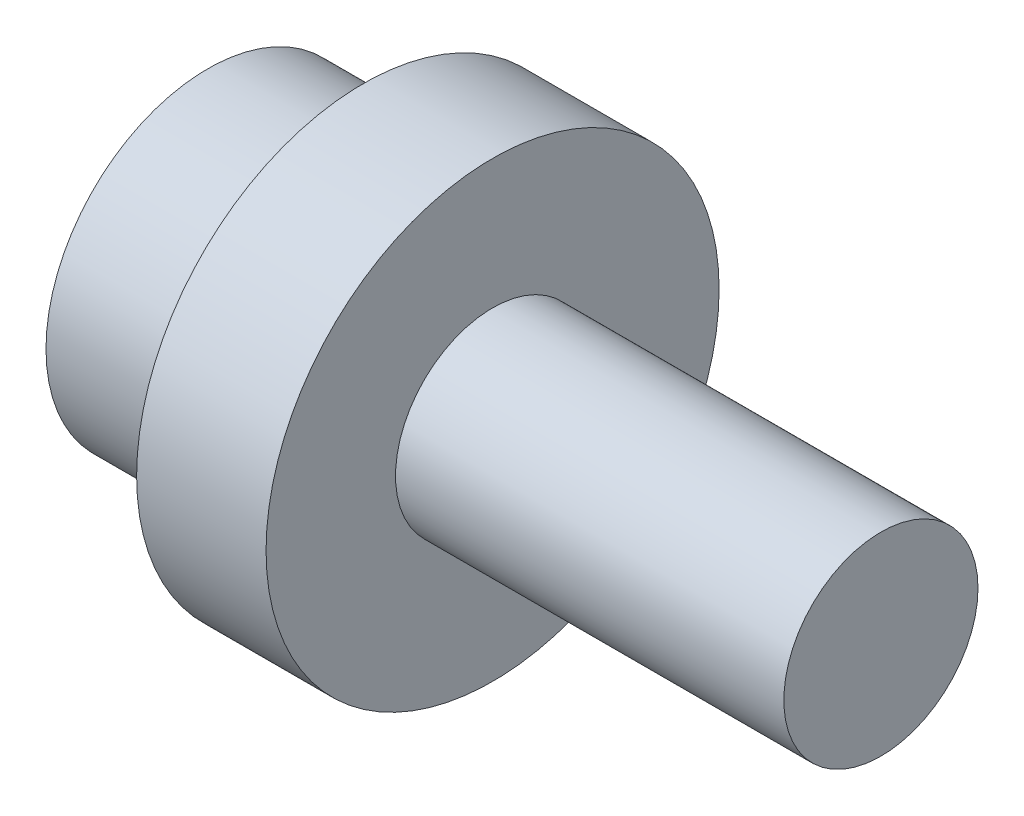
ISO-10303-21;
HEADER;
FILE_DESCRIPTION(('STEP AP214'),'2;1');
FILE_NAME('part.step','',(''),(''),'','','');
FILE_SCHEMA(('AUTOMOTIVE_DESIGN { 1 0 10303 214 1 1 1 1 }'));
ENDSEC;
DATA;
#1=APPLICATION_CONTEXT('core data for automotive mechanical design processes');
#2=APPLICATION_PROTOCOL_DEFINITION('international standard','automotive_design',2000,#1);
#3=PRODUCT_CONTEXT('',#1,'mechanical');
#4=PRODUCT('Part','Part','',(#3));
#5=PRODUCT_RELATED_PRODUCT_CATEGORY('part','',(#4));
#6=PRODUCT_DEFINITION_FORMATION('','',#4);
#7=PRODUCT_DEFINITION_CONTEXT('part definition',#1,'design');
#8=PRODUCT_DEFINITION('design','',#6,#7);
#9=PRODUCT_DEFINITION_SHAPE('','',#8);
#10=(LENGTH_UNIT() NAMED_UNIT(*) SI_UNIT(.MILLI.,.METRE.));
#11=(NAMED_UNIT(*) PLANE_ANGLE_UNIT() SI_UNIT($,.RADIAN.));
#12=(NAMED_UNIT(*) SI_UNIT($,.STERADIAN.) SOLID_ANGLE_UNIT());
#13=UNCERTAINTY_MEASURE_WITH_UNIT(LENGTH_MEASURE(1.E-05),#10,'distance_accuracy_value','');
#14=(GEOMETRIC_REPRESENTATION_CONTEXT(3) GLOBAL_UNCERTAINTY_ASSIGNED_CONTEXT((#13)) GLOBAL_UNIT_ASSIGNED_CONTEXT((#10,
#11,#12)) REPRESENTATION_CONTEXT('',''));
#15=CARTESIAN_POINT('',(0.,0.,0.));
#16=DIRECTION('',(0.,0.,1.));
#17=DIRECTION('',(1.,0.,0.));
#18=AXIS2_PLACEMENT_3D('',#15,#16,#17);
#19=CARTESIAN_POINT('',(0.,0.,0.));
#20=DIRECTION('',(-1.,0.,0.));
#21=DIRECTION('',(0.,0.,1.));
#22=AXIS2_PLACEMENT_3D('',#19,#20,#21);
#23=PLANE('',#22);
#24=CARTESIAN_POINT('',(0.,0.,0.));
#25=DIRECTION('',(1.,0.,0.));
#26=DIRECTION('',(0.,0.,-1.));
#27=AXIS2_PLACEMENT_3D('',#24,#25,#26);
#28=CIRCLE('',#27,12.5000000000002);
#29=CARTESIAN_POINT('',(0.,0.,-12.5000000000002));
#30=VERTEX_POINT('',#29);
#31=EDGE_CURVE('E11',#30,#30,#28,.T.);
#32=ORIENTED_EDGE('',*,*,#31,.F.);
#33=EDGE_LOOP('',(#32));
#34=FACE_BOUND('',#33,.T.);
#35=ADVANCED_FACE('F40',(#34),#23,.T.);
#36=CARTESIAN_POINT('',(0.,0.,0.));
#37=DIRECTION('',(1.,0.,0.));
#38=DIRECTION('',(0.,0.,-1.));
#39=AXIS2_PLACEMENT_3D('',#36,#37,#38);
#40=CYLINDRICAL_SURFACE('',#39,12.5000000000001);
#41=ORIENTED_EDGE('',*,*,#31,.T.);
#42=EDGE_LOOP('',(#41));
#43=FACE_BOUND('',#42,.T.);
#44=CARTESIAN_POINT('',(12.,0.,0.));
#45=DIRECTION('',(1.,0.,0.));
#46=DIRECTION('',(0.,0.,-1.));
#47=AXIS2_PLACEMENT_3D('',#44,#45,#46);
#48=CIRCLE('',#47,12.5);
#49=CARTESIAN_POINT('',(12.,0.,-12.5));
#50=VERTEX_POINT('',#49);
#51=EDGE_CURVE('E46',#50,#50,#48,.T.);
#52=ORIENTED_EDGE('',*,*,#51,.F.);
#53=EDGE_LOOP('',(#52));
#54=FACE_BOUND('',#53,.T.);
#55=ADVANCED_FACE('F88',(#43,#54),#40,.T.);
#56=CARTESIAN_POINT('',(12.,12.5,0.));
#57=DIRECTION('',(-1.,0.,0.));
#58=DIRECTION('',(0.,0.,1.));
#59=AXIS2_PLACEMENT_3D('',#56,#57,#58);
#60=PLANE('',#59);
#61=ORIENTED_EDGE('',*,*,#51,.T.);
#62=EDGE_LOOP('',(#61));
#63=FACE_BOUND('',#62,.T.);
#64=CARTESIAN_POINT('',(12.,0.,0.));
#65=DIRECTION('',(1.,0.,0.));
#66=DIRECTION('',(0.,0.,-1.));
#67=AXIS2_PLACEMENT_3D('',#64,#65,#66);
#68=CIRCLE('',#67,17.5);
#69=CARTESIAN_POINT('',(12.,0.,-17.5));
#70=VERTEX_POINT('',#69);
#71=EDGE_CURVE('E51',#70,#70,#68,.T.);
#72=ORIENTED_EDGE('',*,*,#71,.F.);
#73=EDGE_LOOP('',(#72));
#74=FACE_BOUND('',#73,.T.);
#75=ADVANCED_FACE('F93',(#63,#74),#60,.T.);
#76=CARTESIAN_POINT('',(0.,0.,0.));
#77=DIRECTION('',(1.,0.,0.));
#78=DIRECTION('',(0.,0.,-1.));
#79=AXIS2_PLACEMENT_3D('',#76,#77,#78);
#80=CYLINDRICAL_SURFACE('',#79,17.5);
#81=ORIENTED_EDGE('',*,*,#71,.T.);
#82=EDGE_LOOP('',(#81));
#83=FACE_BOUND('',#82,.T.);
#84=CARTESIAN_POINT('',(22.,0.,0.));
#85=DIRECTION('',(1.,0.,0.));
#86=DIRECTION('',(0.,0.,-1.));
#87=AXIS2_PLACEMENT_3D('',#84,#85,#86);
#88=CIRCLE('',#87,17.5);
#89=CARTESIAN_POINT('',(22.,0.,-17.5));
#90=VERTEX_POINT('',#89);
#91=EDGE_CURVE('E57',#90,#90,#88,.T.);
#92=ORIENTED_EDGE('',*,*,#91,.F.);
#93=EDGE_LOOP('',(#92));
#94=FACE_BOUND('',#93,.T.);
#95=ADVANCED_FACE('F84',(#83,#94),#80,.T.);
#96=CARTESIAN_POINT('',(22.,17.5,0.));
#97=DIRECTION('',(1.,0.,0.));
#98=DIRECTION('',(0.,0.,-1.));
#99=AXIS2_PLACEMENT_3D('',#96,#97,#98);
#100=PLANE('',#99);
#101=ORIENTED_EDGE('',*,*,#91,.T.);
#102=EDGE_LOOP('',(#101));
#103=FACE_BOUND('',#102,.T.);
#104=CARTESIAN_POINT('',(22.,0.,0.));
#105=DIRECTION('',(1.,0.,0.));
#106=DIRECTION('',(0.,0.,-1.));
#107=AXIS2_PLACEMENT_3D('',#104,#105,#106);
#108=CIRCLE('',#107,7.5);
#109=CARTESIAN_POINT('',(22.,0.,-7.5));
#110=VERTEX_POINT('',#109);
#111=EDGE_CURVE('E63',#110,#110,#108,.T.);
#112=ORIENTED_EDGE('',*,*,#111,.F.);
#113=EDGE_LOOP('',(#112));
#114=FACE_BOUND('',#113,.T.);
#115=ADVANCED_FACE('F76',(#103,#114),#100,.T.);
#116=CARTESIAN_POINT('',(0.,0.,0.));
#117=DIRECTION('',(1.,0.,0.));
#118=DIRECTION('',(0.,0.,-1.));
#119=AXIS2_PLACEMENT_3D('',#116,#117,#118);
#120=CYLINDRICAL_SURFACE('',#119,7.5);
#121=ORIENTED_EDGE('',*,*,#111,.T.);
#122=EDGE_LOOP('',(#121));
#123=FACE_BOUND('',#122,.T.);
#124=CARTESIAN_POINT('',(52.,0.,0.));
#125=DIRECTION('',(1.,0.,0.));
#126=DIRECTION('',(0.,0.,-1.));
#127=AXIS2_PLACEMENT_3D('',#124,#125,#126);
#128=CIRCLE('',#127,7.5);
#129=CARTESIAN_POINT('',(52.,0.,-7.5));
#130=VERTEX_POINT('',#129);
#131=EDGE_CURVE('E66',#130,#130,#128,.T.);
#132=ORIENTED_EDGE('',*,*,#131,.F.);
#133=EDGE_LOOP('',(#132));
#134=FACE_BOUND('',#133,.T.);
#135=ADVANCED_FACE('F74',(#123,#134),#120,.T.);
#136=CARTESIAN_POINT('',(52.,7.5,0.));
#137=DIRECTION('',(1.,0.,0.));
#138=DIRECTION('',(0.,0.,-1.));
#139=AXIS2_PLACEMENT_3D('',#136,#137,#138);
#140=PLANE('',#139);
#141=ORIENTED_EDGE('',*,*,#131,.T.);
#142=EDGE_LOOP('',(#141));
#143=FACE_BOUND('',#142,.T.);
#144=ADVANCED_FACE('F72',(#143),#140,.T.);
#145=CLOSED_SHELL('',(#35,#55,#75,#95,#115,#135,#144));
#146=MANIFOLD_SOLID_BREP('B2',#145);
#147=ADVANCED_BREP_SHAPE_REPRESENTATION('',(#18,#146),#14);
#148=SHAPE_DEFINITION_REPRESENTATION(#9,#147);
ENDSEC;
END-ISO-10303-21;
